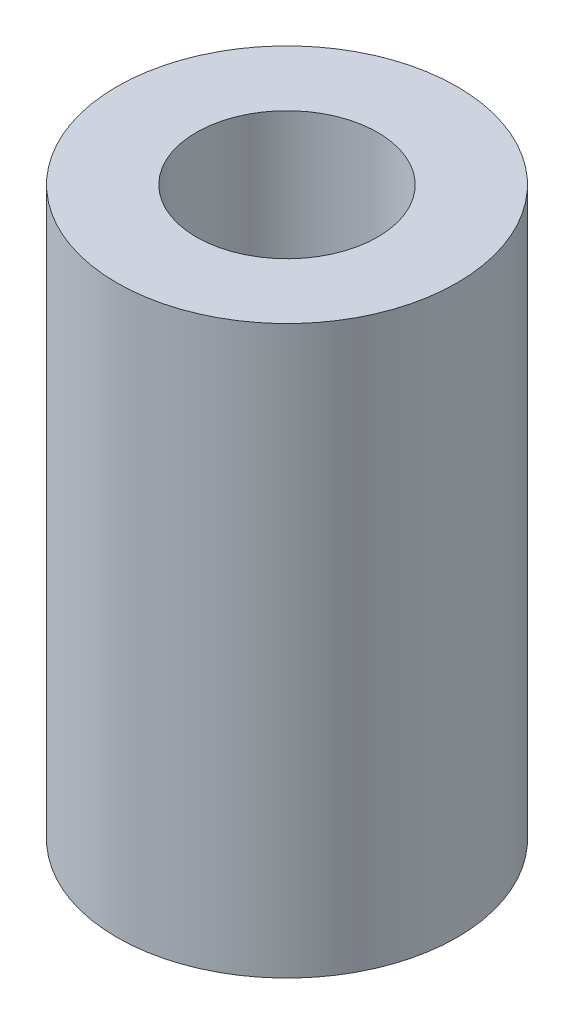
ISO-10303-21;
HEADER;
FILE_DESCRIPTION(('STEP AP214'),'2;1');
FILE_NAME('part.step','',(''),(''),'','','');
FILE_SCHEMA(('AUTOMOTIVE_DESIGN { 1 0 10303 214 1 1 1 1 }'));
ENDSEC;
DATA;
#1=APPLICATION_CONTEXT('core data for automotive mechanical design processes');
#2=APPLICATION_PROTOCOL_DEFINITION('international standard','automotive_design',2000,#1);
#3=PRODUCT_CONTEXT('',#1,'mechanical');
#4=PRODUCT('Part','Part','',(#3));
#5=PRODUCT_RELATED_PRODUCT_CATEGORY('part','',(#4));
#6=PRODUCT_DEFINITION_FORMATION('','',#4);
#7=PRODUCT_DEFINITION_CONTEXT('part definition',#1,'design');
#8=PRODUCT_DEFINITION('design','',#6,#7);
#9=PRODUCT_DEFINITION_SHAPE('','',#8);
#10=(LENGTH_UNIT() NAMED_UNIT(*) SI_UNIT(.MILLI.,.METRE.));
#11=(NAMED_UNIT(*) PLANE_ANGLE_UNIT() SI_UNIT($,.RADIAN.));
#12=(NAMED_UNIT(*) SI_UNIT($,.STERADIAN.) SOLID_ANGLE_UNIT());
#13=UNCERTAINTY_MEASURE_WITH_UNIT(LENGTH_MEASURE(1.E-05),#10,'distance_accuracy_value','');
#14=(GEOMETRIC_REPRESENTATION_CONTEXT(3) GLOBAL_UNCERTAINTY_ASSIGNED_CONTEXT((#13)) GLOBAL_UNIT_ASSIGNED_CONTEXT((#10,
#11,#12)) REPRESENTATION_CONTEXT('',''));
#15=CARTESIAN_POINT('',(0.,0.,0.));
#16=DIRECTION('',(0.,0.,1.));
#17=DIRECTION('',(1.,0.,0.));
#18=AXIS2_PLACEMENT_3D('',#15,#16,#17);
#19=CARTESIAN_POINT('',(0.,25.,0.));
#20=DIRECTION('',(0.,1.,0.));
#21=DIRECTION('',(0.,0.,1.));
#22=AXIS2_PLACEMENT_3D('',#19,#20,#21);
#23=PLANE('',#22);
#24=CARTESIAN_POINT('',(0.,25.,0.));
#25=DIRECTION('',(0.,1.,0.));
#26=DIRECTION('',(0.,0.,1.));
#27=AXIS2_PLACEMENT_3D('',#24,#25,#26);
#28=CIRCLE('',#27,7.5);
#29=CARTESIAN_POINT('',(0.,25.,7.5));
#30=VERTEX_POINT('',#29);
#31=EDGE_CURVE('E10',#30,#30,#28,.T.);
#32=ORIENTED_EDGE('',*,*,#31,.T.);
#33=EDGE_LOOP('',(#32));
#34=FACE_BOUND('',#33,.T.);
#35=CARTESIAN_POINT('',(0.,25.,0.));
#36=DIRECTION('',(0.,1.,0.));
#37=DIRECTION('',(0.,0.,1.));
#38=AXIS2_PLACEMENT_3D('',#35,#36,#37);
#39=CIRCLE('',#38,4.);
#40=CARTESIAN_POINT('',(0.,25.,4.));
#41=VERTEX_POINT('',#40);
#42=EDGE_CURVE('E50',#41,#41,#39,.T.);
#43=ORIENTED_EDGE('',*,*,#42,.F.);
#44=EDGE_LOOP('',(#43));
#45=FACE_BOUND('',#44,.T.);
#46=ADVANCED_FACE('F37',(#34,#45),#23,.T.);
#47=CARTESIAN_POINT('',(0.,0.,0.));
#48=DIRECTION('',(0.,1.,0.));
#49=DIRECTION('',(0.,0.,1.));
#50=AXIS2_PLACEMENT_3D('',#47,#48,#49);
#51=PLANE('',#50);
#52=CARTESIAN_POINT('',(0.,0.,0.));
#53=DIRECTION('',(0.,1.,0.));
#54=DIRECTION('',(0.,0.,1.));
#55=AXIS2_PLACEMENT_3D('',#52,#53,#54);
#56=CIRCLE('',#55,7.5);
#57=CARTESIAN_POINT('',(0.,0.,7.5));
#58=VERTEX_POINT('',#57);
#59=EDGE_CURVE('E41',#58,#58,#56,.T.);
#60=ORIENTED_EDGE('',*,*,#59,.F.);
#61=EDGE_LOOP('',(#60));
#62=FACE_BOUND('',#61,.T.);
#63=CARTESIAN_POINT('',(0.,0.,0.));
#64=DIRECTION('',(0.,1.,0.));
#65=DIRECTION('',(0.,0.,1.));
#66=AXIS2_PLACEMENT_3D('',#63,#64,#65);
#67=CIRCLE('',#66,4.);
#68=CARTESIAN_POINT('',(0.,0.,4.));
#69=VERTEX_POINT('',#68);
#70=EDGE_CURVE('E52',#69,#69,#67,.T.);
#71=ORIENTED_EDGE('',*,*,#70,.T.);
#72=EDGE_LOOP('',(#71));
#73=FACE_BOUND('',#72,.T.);
#74=ADVANCED_FACE('F64',(#62,#73),#51,.F.);
#75=CARTESIAN_POINT('',(0.,25.,0.));
#76=DIRECTION('',(0.,-1.,0.));
#77=DIRECTION('',(0.,0.,-1.));
#78=AXIS2_PLACEMENT_3D('',#75,#76,#77);
#79=CYLINDRICAL_SURFACE('',#78,7.5);
#80=ORIENTED_EDGE('',*,*,#31,.F.);
#81=EDGE_LOOP('',(#80));
#82=FACE_BOUND('',#81,.T.);
#83=ORIENTED_EDGE('',*,*,#59,.T.);
#84=EDGE_LOOP('',(#83));
#85=FACE_BOUND('',#84,.T.);
#86=ADVANCED_FACE('F39',(#82,#85),#79,.T.);
#87=CARTESIAN_POINT('',(0.,25.,0.));
#88=DIRECTION('',(0.,-1.,0.));
#89=DIRECTION('',(0.,0.,-1.));
#90=AXIS2_PLACEMENT_3D('',#87,#88,#89);
#91=CYLINDRICAL_SURFACE('',#90,4.);
#92=ORIENTED_EDGE('',*,*,#42,.T.);
#93=EDGE_LOOP('',(#92));
#94=FACE_BOUND('',#93,.T.);
#95=ORIENTED_EDGE('',*,*,#70,.F.);
#96=EDGE_LOOP('',(#95));
#97=FACE_BOUND('',#96,.T.);
#98=ADVANCED_FACE('F60',(#94,#97),#91,.F.);
#99=CLOSED_SHELL('',(#46,#74,#86,#98));
#100=MANIFOLD_SOLID_BREP('B2',#99);
#101=ADVANCED_BREP_SHAPE_REPRESENTATION('',(#18,#100),#14);
#102=SHAPE_DEFINITION_REPRESENTATION(#9,#101);
ENDSEC;
END-ISO-10303-21;
